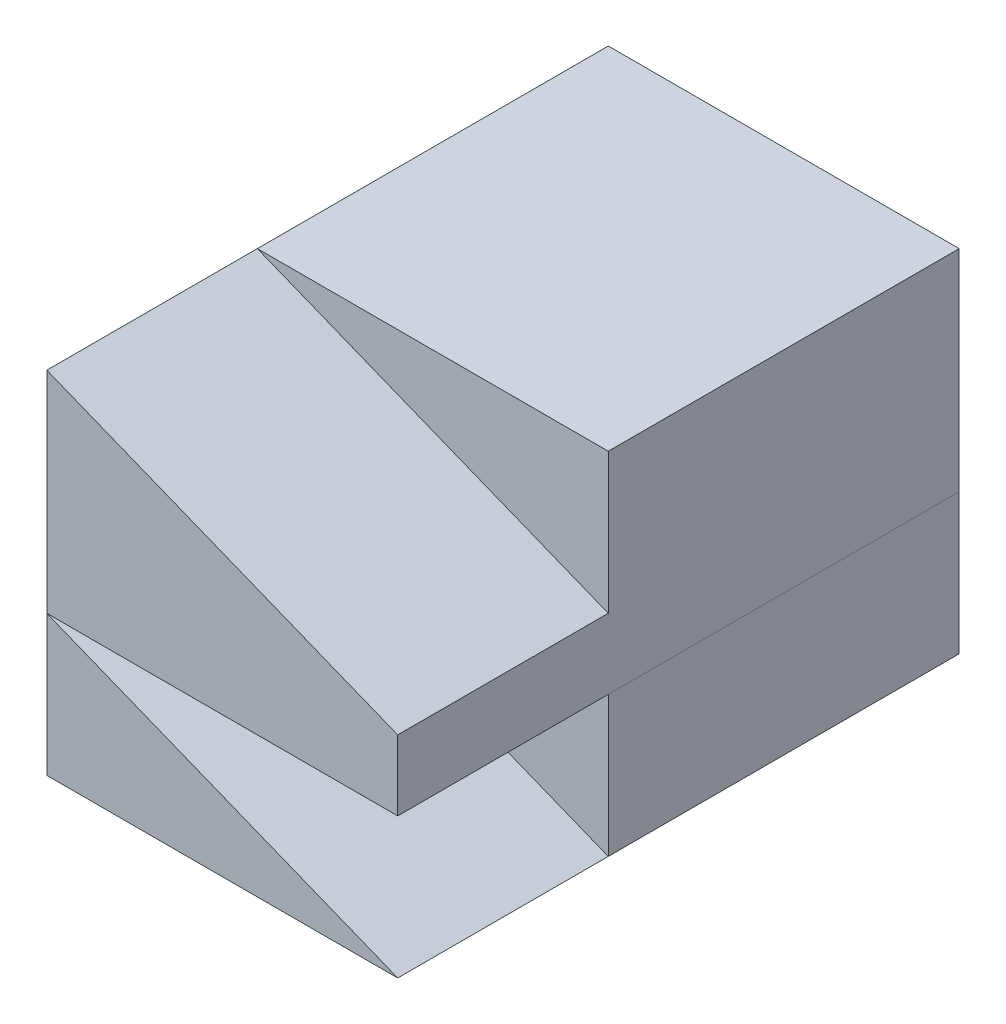
ISO-10303-21;
HEADER;
FILE_DESCRIPTION(('STEP AP214'),'2;1');
FILE_NAME('part.step','',(''),(''),'','','');
FILE_SCHEMA(('AUTOMOTIVE_DESIGN { 1 0 10303 214 1 1 1 1 }'));
ENDSEC;
DATA;
#1=APPLICATION_CONTEXT('core data for automotive mechanical design processes');
#2=APPLICATION_PROTOCOL_DEFINITION('international standard','automotive_design',2000,#1);
#3=PRODUCT_CONTEXT('',#1,'mechanical');
#4=PRODUCT('Part','Part','',(#3));
#5=PRODUCT_RELATED_PRODUCT_CATEGORY('part','',(#4));
#6=PRODUCT_DEFINITION_FORMATION('','',#4);
#7=PRODUCT_DEFINITION_CONTEXT('part definition',#1,'design');
#8=PRODUCT_DEFINITION('design','',#6,#7);
#9=PRODUCT_DEFINITION_SHAPE('','',#8);
#10=(LENGTH_UNIT() NAMED_UNIT(*) SI_UNIT(.MILLI.,.METRE.));
#11=(NAMED_UNIT(*) PLANE_ANGLE_UNIT() SI_UNIT($,.RADIAN.));
#12=(NAMED_UNIT(*) SI_UNIT($,.STERADIAN.) SOLID_ANGLE_UNIT());
#13=UNCERTAINTY_MEASURE_WITH_UNIT(LENGTH_MEASURE(1.E-05),#10,'distance_accuracy_value','');
#14=(GEOMETRIC_REPRESENTATION_CONTEXT(3) GLOBAL_UNCERTAINTY_ASSIGNED_CONTEXT((#13)) GLOBAL_UNIT_ASSIGNED_CONTEXT((#10,
#11,#12)) REPRESENTATION_CONTEXT('',''));
#15=CARTESIAN_POINT('',(0.,0.,0.));
#16=DIRECTION('',(0.,0.,1.));
#17=DIRECTION('',(1.,0.,0.));
#18=AXIS2_PLACEMENT_3D('',#15,#16,#17);
#19=CARTESIAN_POINT('',(-25.,10.,-25.));
#20=DIRECTION('',(0.,1.,0.));
#21=DIRECTION('',(0.,0.,1.));
#22=AXIS2_PLACEMENT_3D('',#19,#20,#21);
#23=PLANE('',#22);
#24=DIRECTION('',(0.,0.,1.));
#25=VECTOR('',#24,1.);
#26=CARTESIAN_POINT('',(0.,10.,-25.));
#27=LINE('',#26,#25);
#28=CARTESIAN_POINT('',(0.,10.,-25.));
#29=VERTEX_POINT('',#28);
#30=CARTESIAN_POINT('',(0.,10.,0.));
#31=VERTEX_POINT('',#30);
#32=EDGE_CURVE('E108',#29,#31,#27,.T.);
#33=ORIENTED_EDGE('',*,*,#32,.F.);
#34=DIRECTION('',(1.,0.,0.));
#35=VECTOR('',#34,1.);
#36=CARTESIAN_POINT('',(-25.,10.,-25.));
#37=LINE('',#36,#35);
#38=CARTESIAN_POINT('',(-25.,10.,-25.));
#39=VERTEX_POINT('',#38);
#40=EDGE_CURVE('E12',#39,#29,#37,.T.);
#41=ORIENTED_EDGE('',*,*,#40,.F.);
#42=DIRECTION('',(0.,0.,1.));
#43=VECTOR('',#42,1.);
#44=CARTESIAN_POINT('',(-25.,10.,-25.));
#45=LINE('',#44,#43);
#46=CARTESIAN_POINT('',(-25.,10.,0.));
#47=VERTEX_POINT('',#46);
#48=EDGE_CURVE('E102',#39,#47,#45,.T.);
#49=ORIENTED_EDGE('',*,*,#48,.T.);
#50=DIRECTION('',(1.,0.,0.));
#51=VECTOR('',#50,1.);
#52=CARTESIAN_POINT('',(-25.,10.,0.));
#53=LINE('',#52,#51);
#54=EDGE_CURVE('E47',#47,#31,#53,.T.);
#55=ORIENTED_EDGE('',*,*,#54,.T.);
#56=EDGE_LOOP('',(#33,#41,#49,#55));
#57=FACE_BOUND('',#56,.T.);
#58=ADVANCED_FACE('F44',(#57),#23,.T.);
#59=CARTESIAN_POINT('',(-25.,0.,-25.));
#60=DIRECTION('',(0.,0.,-1.));
#61=DIRECTION('',(-1.,0.,0.));
#62=AXIS2_PLACEMENT_3D('',#59,#60,#61);
#63=PLANE('',#62);
#64=DIRECTION('',(0.,1.,0.));
#65=VECTOR('',#64,1.);
#66=CARTESIAN_POINT('',(0.,0.,-25.));
#67=LINE('',#66,#65);
#68=CARTESIAN_POINT('',(0.,0.,-25.));
#69=VERTEX_POINT('',#68);
#70=EDGE_CURVE('E104',#69,#29,#67,.T.);
#71=ORIENTED_EDGE('',*,*,#70,.F.);
#72=DIRECTION('',(1.,0.,0.));
#73=VECTOR('',#72,1.);
#74=CARTESIAN_POINT('',(-25.,0.,-25.));
#75=LINE('',#74,#73);
#76=CARTESIAN_POINT('',(-25.,0.,-25.));
#77=VERTEX_POINT('',#76);
#78=EDGE_CURVE('E53',#77,#69,#75,.T.);
#79=ORIENTED_EDGE('',*,*,#78,.F.);
#80=DIRECTION('',(0.,1.,0.));
#81=VECTOR('',#80,1.);
#82=CARTESIAN_POINT('',(-25.,0.,-25.));
#83=LINE('',#82,#81);
#84=EDGE_CURVE('E99',#77,#39,#83,.T.);
#85=ORIENTED_EDGE('',*,*,#84,.T.);
#86=ORIENTED_EDGE('',*,*,#40,.T.);
#87=EDGE_LOOP('',(#71,#79,#85,#86));
#88=FACE_BOUND('',#87,.T.);
#89=ADVANCED_FACE('F118',(#88),#63,.T.);
#90=CARTESIAN_POINT('',(-25.,0.,0.));
#91=DIRECTION('',(0.,-1.,0.));
#92=DIRECTION('',(0.,0.,-1.));
#93=AXIS2_PLACEMENT_3D('',#90,#91,#92);
#94=PLANE('',#93);
#95=DIRECTION('',(0.,0.,-1.));
#96=VECTOR('',#95,1.);
#97=CARTESIAN_POINT('',(0.,0.,0.));
#98=LINE('',#97,#96);
#99=CARTESIAN_POINT('',(0.,0.,0.));
#100=VERTEX_POINT('',#99);
#101=EDGE_CURVE('E94',#100,#69,#98,.T.);
#102=ORIENTED_EDGE('',*,*,#101,.F.);
#103=DIRECTION('',(1.,0.,0.));
#104=VECTOR('',#103,1.);
#105=CARTESIAN_POINT('',(-25.,0.,0.));
#106=LINE('',#105,#104);
#107=CARTESIAN_POINT('',(-25.,0.,0.));
#108=VERTEX_POINT('',#107);
#109=EDGE_CURVE('E89',#108,#100,#106,.T.);
#110=ORIENTED_EDGE('',*,*,#109,.F.);
#111=DIRECTION('',(0.,0.,-1.));
#112=VECTOR('',#111,1.);
#113=CARTESIAN_POINT('',(-25.,0.,0.));
#114=LINE('',#113,#112);
#115=EDGE_CURVE('E92',#108,#77,#114,.T.);
#116=ORIENTED_EDGE('',*,*,#115,.T.);
#117=ORIENTED_EDGE('',*,*,#78,.T.);
#118=EDGE_LOOP('',(#102,#110,#116,#117));
#119=FACE_BOUND('',#118,.T.);
#120=ADVANCED_FACE('F91',(#119),#94,.T.);
#121=CARTESIAN_POINT('',(-25.,10.,0.));
#122=DIRECTION('',(0.,0.,1.));
#123=DIRECTION('',(1.,0.,0.));
#124=AXIS2_PLACEMENT_3D('',#121,#122,#123);
#125=PLANE('',#124);
#126=DIRECTION('',(0.,-1.,0.));
#127=VECTOR('',#126,1.);
#128=CARTESIAN_POINT('',(0.,10.,0.));
#129=LINE('',#128,#127);
#130=EDGE_CURVE('E111',#31,#100,#129,.T.);
#131=ORIENTED_EDGE('',*,*,#130,.F.);
#132=ORIENTED_EDGE('',*,*,#54,.F.);
#133=DIRECTION('',(0.,-1.,0.));
#134=VECTOR('',#133,1.);
#135=CARTESIAN_POINT('',(-25.,10.,0.));
#136=LINE('',#135,#134);
#137=EDGE_CURVE('E98',#47,#108,#136,.T.);
#138=ORIENTED_EDGE('',*,*,#137,.T.);
#139=ORIENTED_EDGE('',*,*,#109,.T.);
#140=EDGE_LOOP('',(#131,#132,#138,#139));
#141=FACE_BOUND('',#140,.T.);
#142=ADVANCED_FACE('F101',(#141),#125,.T.);
#143=CARTESIAN_POINT('',(-25.,0.,0.));
#144=DIRECTION('',(1.,0.,0.));
#145=DIRECTION('',(0.,0.,-1.));
#146=AXIS2_PLACEMENT_3D('',#143,#144,#145);
#147=PLANE('',#146);
#148=ORIENTED_EDGE('',*,*,#48,.F.);
#149=ORIENTED_EDGE('',*,*,#84,.F.);
#150=ORIENTED_EDGE('',*,*,#115,.F.);
#151=ORIENTED_EDGE('',*,*,#137,.F.);
#152=EDGE_LOOP('',(#148,#149,#150,#151));
#153=FACE_BOUND('',#152,.T.);
#154=ADVANCED_FACE('F97',(#153),#147,.F.);
#155=CARTESIAN_POINT('',(0.,0.,0.));
#156=DIRECTION('',(1.,0.,0.));
#157=DIRECTION('',(0.,0.,-1.));
#158=AXIS2_PLACEMENT_3D('',#155,#156,#157);
#159=PLANE('',#158);
#160=ORIENTED_EDGE('',*,*,#32,.T.);
#161=ORIENTED_EDGE('',*,*,#130,.T.);
#162=ORIENTED_EDGE('',*,*,#101,.T.);
#163=ORIENTED_EDGE('',*,*,#70,.T.);
#164=EDGE_LOOP('',(#160,#161,#162,#163));
#165=FACE_BOUND('',#164,.T.);
#166=ADVANCED_FACE('F117',(#165),#159,.T.);
#167=CLOSED_SHELL('',(#58,#89,#120,#142,#154,#166));
#168=MANIFOLD_SOLID_BREP('B2',#167);
#169=CARTESIAN_POINT('',(0.,15.,15.));
#170=DIRECTION('',(0.,0.,1.));
#171=DIRECTION('',(1.,0.,0.));
#172=AXIS2_PLACEMENT_3D('',#169,#170,#171);
#173=PLANE('',#172);
#174=DIRECTION('',(0.,1.,0.));
#175=VECTOR('',#174,1.);
#176=CARTESIAN_POINT('',(-25.,15.,15.));
#177=LINE('',#176,#175);
#178=CARTESIAN_POINT('',(-25.,10.,15.));
#179=VERTEX_POINT('',#178);
#180=CARTESIAN_POINT('',(-25.,25.,15.));
#181=VERTEX_POINT('',#180);
#182=EDGE_CURVE('E233',#179,#181,#177,.T.);
#183=ORIENTED_EDGE('',*,*,#182,.F.);
#184=DIRECTION('',(-1.,0.,0.));
#185=VECTOR('',#184,1.);
#186=CARTESIAN_POINT('',(0.,10.,15.));
#187=LINE('',#186,#185);
#188=CARTESIAN_POINT('',(0.,10.,15.));
#189=VERTEX_POINT('',#188);
#190=EDGE_CURVE('E42',#189,#179,#187,.T.);
#191=ORIENTED_EDGE('',*,*,#190,.F.);
#192=DIRECTION('',(0.,1.,0.));
#193=VECTOR('',#192,1.);
#194=CARTESIAN_POINT('',(0.,15.,15.));
#195=LINE('',#194,#193);
#196=CARTESIAN_POINT('',(0.,15.,15.));
#197=VERTEX_POINT('',#196);
#198=EDGE_CURVE('E187',#189,#197,#195,.T.);
#199=ORIENTED_EDGE('',*,*,#198,.T.);
#200=DIRECTION('',(-0.928476690885259,0.371390676354104,0.));
#201=VECTOR('',#200,1.);
#202=CARTESIAN_POINT('',(-25.,25.,15.));
#203=LINE('',#202,#201);
#204=EDGE_CURVE('E264',#197,#181,#203,.T.);
#205=ORIENTED_EDGE('',*,*,#204,.T.);
#206=EDGE_LOOP('',(#183,#191,#199,#205));
#207=FACE_BOUND('',#206,.T.);
#208=ADVANCED_FACE('F177',(#207),#173,.T.);
#209=CARTESIAN_POINT('',(0.,10.,15.));
#210=DIRECTION('',(0.,-1.,0.));
#211=DIRECTION('',(0.,0.,-1.));
#212=AXIS2_PLACEMENT_3D('',#209,#210,#211);
#213=PLANE('',#212);
#214=DIRECTION('',(0.,0.,1.));
#215=VECTOR('',#214,1.);
#216=CARTESIAN_POINT('',(-25.,10.,15.));
#217=LINE('',#216,#215);
#218=CARTESIAN_POINT('',(-25.,10.,-25.));
#219=VERTEX_POINT('',#218);
#220=EDGE_CURVE('E226',#219,#179,#217,.T.);
#221=ORIENTED_EDGE('',*,*,#220,.F.);
#222=DIRECTION('',(-1.,0.,0.));
#223=VECTOR('',#222,1.);
#224=CARTESIAN_POINT('',(0.,10.,-25.));
#225=LINE('',#224,#223);
#226=CARTESIAN_POINT('',(0.,10.,-25.));
#227=VERTEX_POINT('',#226);
#228=EDGE_CURVE('E230',#227,#219,#225,.T.);
#229=ORIENTED_EDGE('',*,*,#228,.F.);
#230=DIRECTION('',(0.,0.,1.));
#231=VECTOR('',#230,1.);
#232=CARTESIAN_POINT('',(0.,10.,15.));
#233=LINE('',#232,#231);
#234=EDGE_CURVE('E270',#227,#189,#233,.T.);
#235=ORIENTED_EDGE('',*,*,#234,.T.);
#236=ORIENTED_EDGE('',*,*,#190,.T.);
#237=EDGE_LOOP('',(#221,#229,#235,#236));
#238=FACE_BOUND('',#237,.T.);
#239=ADVANCED_FACE('F179',(#238),#213,.T.);
#240=CARTESIAN_POINT('',(0.,0.,0.));
#241=DIRECTION('',(1.,0.,0.));
#242=DIRECTION('',(0.,0.,-1.));
#243=AXIS2_PLACEMENT_3D('',#240,#241,#242);
#244=PLANE('',#243);
#245=DIRECTION('',(0.,0.,-1.));
#246=VECTOR('',#245,1.);
#247=CARTESIAN_POINT('',(0.,15.,0.));
#248=LINE('',#247,#246);
#249=CARTESIAN_POINT('',(0.,15.,0.));
#250=VERTEX_POINT('',#249);
#251=EDGE_CURVE('E195',#197,#250,#248,.T.);
#252=ORIENTED_EDGE('',*,*,#251,.F.);
#253=ORIENTED_EDGE('',*,*,#198,.F.);
#254=ORIENTED_EDGE('',*,*,#234,.F.);
#255=DIRECTION('',(0.,-1.,0.));
#256=VECTOR('',#255,1.);
#257=CARTESIAN_POINT('',(0.,0.,-25.));
#258=LINE('',#257,#256);
#259=CARTESIAN_POINT('',(0.,25.,-25.));
#260=VERTEX_POINT('',#259);
#261=EDGE_CURVE('E250',#260,#227,#258,.T.);
#262=ORIENTED_EDGE('',*,*,#261,.F.);
#263=DIRECTION('',(0.,0.,1.));
#264=VECTOR('',#263,1.);
#265=CARTESIAN_POINT('',(0.,25.,-25.));
#266=LINE('',#265,#264);
#267=CARTESIAN_POINT('',(0.,25.,0.));
#268=VERTEX_POINT('',#267);
#269=EDGE_CURVE('E258',#260,#268,#266,.T.);
#270=ORIENTED_EDGE('',*,*,#269,.T.);
#271=DIRECTION('',(0.,-1.,0.));
#272=VECTOR('',#271,1.);
#273=CARTESIAN_POINT('',(0.,0.,0.));
#274=LINE('',#273,#272);
#275=EDGE_CURVE('E251',#268,#250,#274,.T.);
#276=ORIENTED_EDGE('',*,*,#275,.T.);
#277=EDGE_LOOP('',(#252,#253,#254,#262,#270,#276));
#278=FACE_BOUND('',#277,.T.);
#279=ADVANCED_FACE('F281',(#278),#244,.T.);
#280=CARTESIAN_POINT('',(-25.,0.,0.));
#281=DIRECTION('',(1.,0.,0.));
#282=DIRECTION('',(0.,0.,-1.));
#283=AXIS2_PLACEMENT_3D('',#280,#281,#282);
#284=PLANE('',#283);
#285=ORIENTED_EDGE('',*,*,#182,.T.);
#286=DIRECTION('',(0.,0.,1.));
#287=VECTOR('',#286,1.);
#288=CARTESIAN_POINT('',(-25.,25.,0.));
#289=LINE('',#288,#287);
#290=CARTESIAN_POINT('',(-25.,25.,0.));
#291=VERTEX_POINT('',#290);
#292=EDGE_CURVE('E234',#291,#181,#289,.T.);
#293=ORIENTED_EDGE('',*,*,#292,.F.);
#294=DIRECTION('',(0.,0.,1.));
#295=VECTOR('',#294,1.);
#296=CARTESIAN_POINT('',(-25.,25.,-25.));
#297=LINE('',#296,#295);
#298=CARTESIAN_POINT('',(-25.,25.,-25.));
#299=VERTEX_POINT('',#298);
#300=EDGE_CURVE('E241',#299,#291,#297,.T.);
#301=ORIENTED_EDGE('',*,*,#300,.F.);
#302=DIRECTION('',(0.,1.,0.));
#303=VECTOR('',#302,1.);
#304=CARTESIAN_POINT('',(-25.,0.,-25.));
#305=LINE('',#304,#303);
#306=EDGE_CURVE('E237',#219,#299,#305,.T.);
#307=ORIENTED_EDGE('',*,*,#306,.F.);
#308=ORIENTED_EDGE('',*,*,#220,.T.);
#309=EDGE_LOOP('',(#285,#293,#301,#307,#308));
#310=FACE_BOUND('',#309,.T.);
#311=ADVANCED_FACE('F238',(#310),#284,.F.);
#312=CARTESIAN_POINT('',(-25.,25.,0.));
#313=DIRECTION('',(0.371390676354104,0.928476690885259,0.));
#314=DIRECTION('',(-0.928476690885259,0.371390676354104,0.));
#315=AXIS2_PLACEMENT_3D('',#312,#313,#314);
#316=PLANE('',#315);
#317=ORIENTED_EDGE('',*,*,#204,.F.);
#318=ORIENTED_EDGE('',*,*,#251,.T.);
#319=DIRECTION('',(-0.928476690885259,0.371390676354104,0.));
#320=VECTOR('',#319,1.);
#321=CARTESIAN_POINT('',(-25.,25.,0.));
#322=LINE('',#321,#320);
#323=EDGE_CURVE('E267',#250,#291,#322,.T.);
#324=ORIENTED_EDGE('',*,*,#323,.T.);
#325=ORIENTED_EDGE('',*,*,#292,.T.);
#326=EDGE_LOOP('',(#317,#318,#324,#325));
#327=FACE_BOUND('',#326,.T.);
#328=ADVANCED_FACE('F279',(#327),#316,.T.);
#329=CARTESIAN_POINT('',(0.,25.,-25.));
#330=DIRECTION('',(0.,1.,0.));
#331=DIRECTION('',(0.,0.,1.));
#332=AXIS2_PLACEMENT_3D('',#329,#330,#331);
#333=PLANE('',#332);
#334=DIRECTION('',(-1.,0.,0.));
#335=VECTOR('',#334,1.);
#336=CARTESIAN_POINT('',(0.,25.,0.));
#337=LINE('',#336,#335);
#338=EDGE_CURVE('E253',#268,#291,#337,.T.);
#339=ORIENTED_EDGE('',*,*,#338,.F.);
#340=ORIENTED_EDGE('',*,*,#269,.F.);
#341=DIRECTION('',(-1.,0.,0.));
#342=VECTOR('',#341,1.);
#343=CARTESIAN_POINT('',(0.,25.,-25.));
#344=LINE('',#343,#342);
#345=EDGE_CURVE('E245',#260,#299,#344,.T.);
#346=ORIENTED_EDGE('',*,*,#345,.T.);
#347=ORIENTED_EDGE('',*,*,#300,.T.);
#348=EDGE_LOOP('',(#339,#340,#346,#347));
#349=FACE_BOUND('',#348,.T.);
#350=ADVANCED_FACE('F285',(#349),#333,.T.);
#351=CARTESIAN_POINT('',(0.,0.,-25.));
#352=DIRECTION('',(0.,0.,-1.));
#353=DIRECTION('',(-1.,0.,0.));
#354=AXIS2_PLACEMENT_3D('',#351,#352,#353);
#355=PLANE('',#354);
#356=ORIENTED_EDGE('',*,*,#228,.T.);
#357=ORIENTED_EDGE('',*,*,#306,.T.);
#358=ORIENTED_EDGE('',*,*,#345,.F.);
#359=ORIENTED_EDGE('',*,*,#261,.T.);
#360=EDGE_LOOP('',(#356,#357,#358,#359));
#361=FACE_BOUND('',#360,.T.);
#362=ADVANCED_FACE('F248',(#361),#355,.T.);
#363=CARTESIAN_POINT('',(0.,0.,0.));
#364=DIRECTION('',(0.,0.,-1.));
#365=DIRECTION('',(-1.,0.,0.));
#366=AXIS2_PLACEMENT_3D('',#363,#364,#365);
#367=PLANE('',#366);
#368=ORIENTED_EDGE('',*,*,#323,.F.);
#369=ORIENTED_EDGE('',*,*,#275,.F.);
#370=ORIENTED_EDGE('',*,*,#338,.T.);
#371=EDGE_LOOP('',(#368,#369,#370));
#372=FACE_BOUND('',#371,.T.);
#373=ADVANCED_FACE('F287',(#372),#367,.F.);
#374=CLOSED_SHELL('',(#208,#239,#279,#311,#328,#350,#362,#373));
#375=MANIFOLD_SOLID_BREP('B6',#374);
#376=CARTESIAN_POINT('',(0.,0.,15.));
#377=DIRECTION('',(-0.371390676354104,-0.928476690885259,0.));
#378=DIRECTION('',(0.928476690885259,-0.371390676354104,0.));
#379=AXIS2_PLACEMENT_3D('',#376,#377,#378);
#380=PLANE('',#379);
#381=DIRECTION('',(0.,0.,-1.));
#382=VECTOR('',#381,1.);
#383=CARTESIAN_POINT('',(0.,0.,15.));
#384=LINE('',#383,#382);
#385=CARTESIAN_POINT('',(0.,0.,15.));
#386=VERTEX_POINT('',#385);
#387=CARTESIAN_POINT('',(0.,0.,-25.));
#388=VERTEX_POINT('',#387);
#389=EDGE_CURVE('E423',#386,#388,#384,.T.);
#390=ORIENTED_EDGE('',*,*,#389,.T.);
#391=DIRECTION('',(-0.928476690885259,0.371390676354104,0.));
#392=VECTOR('',#391,1.);
#393=CARTESIAN_POINT('',(0.,0.,-25.));
#394=LINE('',#393,#392);
#395=CARTESIAN_POINT('',(-25.,10.,-25.));
#396=VERTEX_POINT('',#395);
#397=EDGE_CURVE('E430',#388,#396,#394,.T.);
#398=ORIENTED_EDGE('',*,*,#397,.T.);
#399=DIRECTION('',(0.,0.,-1.));
#400=VECTOR('',#399,1.);
#401=CARTESIAN_POINT('',(-25.,10.,15.));
#402=LINE('',#401,#400);
#403=CARTESIAN_POINT('',(-25.,10.,15.));
#404=VERTEX_POINT('',#403);
#405=EDGE_CURVE('E175',#404,#396,#402,.T.);
#406=ORIENTED_EDGE('',*,*,#405,.F.);
#407=DIRECTION('',(-0.928476690885259,0.371390676354104,0.));
#408=VECTOR('',#407,1.);
#409=CARTESIAN_POINT('',(0.,0.,15.));
#410=LINE('',#409,#408);
#411=EDGE_CURVE('E436',#386,#404,#410,.T.);
#412=ORIENTED_EDGE('',*,*,#411,.F.);
#413=EDGE_LOOP('',(#390,#398,#406,#412));
#414=FACE_BOUND('',#413,.T.);
#415=ADVANCED_FACE('F386',(#414),#380,.F.);
#416=CARTESIAN_POINT('',(-25.,10.,15.));
#417=DIRECTION('',(1.,0.,0.));
#418=DIRECTION('',(0.,0.,-1.));
#419=AXIS2_PLACEMENT_3D('',#416,#417,#418);
#420=PLANE('',#419);
#421=ORIENTED_EDGE('',*,*,#405,.T.);
#422=DIRECTION('',(0.,1.,0.));
#423=VECTOR('',#422,1.);
#424=CARTESIAN_POINT('',(-25.,0.,-25.));
#425=LINE('',#424,#423);
#426=CARTESIAN_POINT('',(-25.,0.,-25.));
#427=VERTEX_POINT('',#426);
#428=EDGE_CURVE('E425',#427,#396,#425,.T.);
#429=ORIENTED_EDGE('',*,*,#428,.F.);
#430=DIRECTION('',(0.,0.,-1.));
#431=VECTOR('',#430,1.);
#432=CARTESIAN_POINT('',(-25.,0.,15.));
#433=LINE('',#432,#431);
#434=CARTESIAN_POINT('',(-25.,0.,15.));
#435=VERTEX_POINT('',#434);
#436=EDGE_CURVE('E393',#435,#427,#433,.T.);
#437=ORIENTED_EDGE('',*,*,#436,.F.);
#438=DIRECTION('',(0.,-1.,0.));
#439=VECTOR('',#438,1.);
#440=CARTESIAN_POINT('',(-25.,10.,15.));
#441=LINE('',#440,#439);
#442=EDGE_CURVE('E404',#404,#435,#441,.T.);
#443=ORIENTED_EDGE('',*,*,#442,.F.);
#444=EDGE_LOOP('',(#421,#429,#437,#443));
#445=FACE_BOUND('',#444,.T.);
#446=ADVANCED_FACE('F426',(#445),#420,.F.);
#447=CARTESIAN_POINT('',(-25.,0.,15.));
#448=DIRECTION('',(0.,1.,0.));
#449=DIRECTION('',(0.,0.,1.));
#450=AXIS2_PLACEMENT_3D('',#447,#448,#449);
#451=PLANE('',#450);
#452=ORIENTED_EDGE('',*,*,#436,.T.);
#453=DIRECTION('',(-1.,0.,0.));
#454=VECTOR('',#453,1.);
#455=CARTESIAN_POINT('',(0.,0.,-25.));
#456=LINE('',#455,#454);
#457=EDGE_CURVE('E420',#388,#427,#456,.T.);
#458=ORIENTED_EDGE('',*,*,#457,.F.);
#459=ORIENTED_EDGE('',*,*,#389,.F.);
#460=DIRECTION('',(1.,0.,0.));
#461=VECTOR('',#460,1.);
#462=CARTESIAN_POINT('',(-25.,0.,15.));
#463=LINE('',#462,#461);
#464=EDGE_CURVE('E400',#435,#386,#463,.T.);
#465=ORIENTED_EDGE('',*,*,#464,.F.);
#466=EDGE_LOOP('',(#452,#458,#459,#465));
#467=FACE_BOUND('',#466,.T.);
#468=ADVANCED_FACE('F418',(#467),#451,.F.);
#469=CARTESIAN_POINT('',(0.,0.,15.));
#470=DIRECTION('',(0.,0.,1.));
#471=DIRECTION('',(1.,0.,0.));
#472=AXIS2_PLACEMENT_3D('',#469,#470,#471);
#473=PLANE('',#472);
#474=ORIENTED_EDGE('',*,*,#411,.T.);
#475=ORIENTED_EDGE('',*,*,#442,.T.);
#476=ORIENTED_EDGE('',*,*,#464,.T.);
#477=EDGE_LOOP('',(#474,#475,#476));
#478=FACE_BOUND('',#477,.T.);
#479=ADVANCED_FACE('F442',(#478),#473,.T.);
#480=CARTESIAN_POINT('',(0.,0.,-25.));
#481=DIRECTION('',(0.,0.,-1.));
#482=DIRECTION('',(-1.,0.,0.));
#483=AXIS2_PLACEMENT_3D('',#480,#481,#482);
#484=PLANE('',#483);
#485=ORIENTED_EDGE('',*,*,#457,.T.);
#486=ORIENTED_EDGE('',*,*,#428,.T.);
#487=ORIENTED_EDGE('',*,*,#397,.F.);
#488=EDGE_LOOP('',(#485,#486,#487));
#489=FACE_BOUND('',#488,.T.);
#490=ADVANCED_FACE('F432',(#489),#484,.T.);
#491=CLOSED_SHELL('',(#415,#446,#468,#479,#490));
#492=MANIFOLD_SOLID_BREP('B36',#491);
#493=ADVANCED_BREP_SHAPE_REPRESENTATION('',(#18,#168,#375,#492),#14);
#494=SHAPE_DEFINITION_REPRESENTATION(#9,#493);
ENDSEC;
END-ISO-10303-21;
